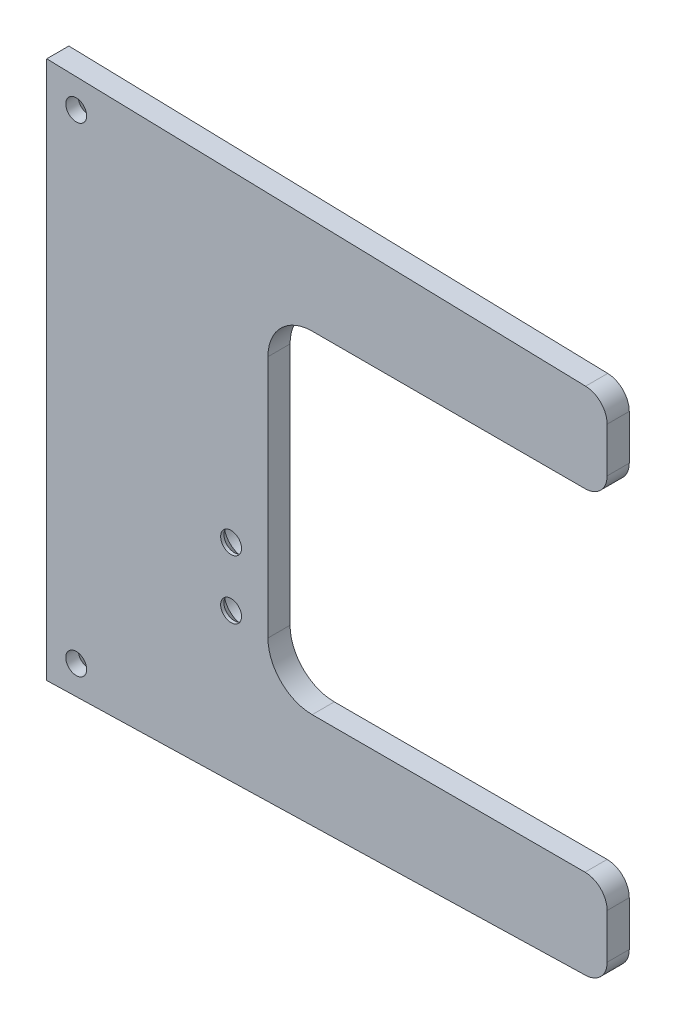
ISO-10303-21;
HEADER;
FILE_DESCRIPTION(('STEP AP214'),'2;1');
FILE_NAME('part.step','',(''),(''),'','','');
FILE_SCHEMA(('AUTOMOTIVE_DESIGN { 1 0 10303 214 1 1 1 1 }'));
ENDSEC;
DATA;
#1=APPLICATION_CONTEXT('core data for automotive mechanical design processes');
#2=APPLICATION_PROTOCOL_DEFINITION('international standard','automotive_design',2000,#1);
#3=PRODUCT_CONTEXT('',#1,'mechanical');
#4=PRODUCT('Part','Part','',(#3));
#5=PRODUCT_RELATED_PRODUCT_CATEGORY('part','',(#4));
#6=PRODUCT_DEFINITION_FORMATION('','',#4);
#7=PRODUCT_DEFINITION_CONTEXT('part definition',#1,'design');
#8=PRODUCT_DEFINITION('design','',#6,#7);
#9=PRODUCT_DEFINITION_SHAPE('','',#8);
#10=(LENGTH_UNIT() NAMED_UNIT(*) SI_UNIT(.MILLI.,.METRE.));
#11=(NAMED_UNIT(*) PLANE_ANGLE_UNIT() SI_UNIT($,.RADIAN.));
#12=(NAMED_UNIT(*) SI_UNIT($,.STERADIAN.) SOLID_ANGLE_UNIT());
#13=UNCERTAINTY_MEASURE_WITH_UNIT(LENGTH_MEASURE(1.E-05),#10,'distance_accuracy_value','');
#14=(GEOMETRIC_REPRESENTATION_CONTEXT(3) GLOBAL_UNCERTAINTY_ASSIGNED_CONTEXT((#13)) GLOBAL_UNIT_ASSIGNED_CONTEXT((#10,
#11,#12)) REPRESENTATION_CONTEXT('',''));
#15=CARTESIAN_POINT('',(0.,0.,0.));
#16=DIRECTION('',(0.,0.,1.));
#17=DIRECTION('',(1.,0.,0.));
#18=AXIS2_PLACEMENT_3D('',#15,#16,#17);
#19=CARTESIAN_POINT('',(-47.625,115.91925,-9.525));
#20=DIRECTION('',(1.,0.,0.));
#21=DIRECTION('',(0.,1.,0.));
#22=AXIS2_PLACEMENT_3D('',#19,#20,#21);
#23=PLANE('',#22);
#24=DIRECTION('',(0.,-1.,0.));
#25=VECTOR('',#24,1.);
#26=CARTESIAN_POINT('',(-47.625,115.91925,0.));
#27=LINE('',#26,#25);
#28=CARTESIAN_POINT('',(-47.625,115.91925,0.));
#29=VERTEX_POINT('',#28);
#30=CARTESIAN_POINT('',(-47.625,-115.91925,0.));
#31=VERTEX_POINT('',#30);
#32=EDGE_CURVE('E176',#29,#31,#27,.T.);
#33=ORIENTED_EDGE('',*,*,#32,.F.);
#34=DIRECTION('',(0.,0.,1.));
#35=VECTOR('',#34,1.);
#36=CARTESIAN_POINT('',(-47.625,115.91925,-9.525));
#37=LINE('',#36,#35);
#38=CARTESIAN_POINT('',(-47.625,115.91925,-9.525));
#39=VERTEX_POINT('',#38);
#40=EDGE_CURVE('E164',#39,#29,#37,.T.);
#41=ORIENTED_EDGE('',*,*,#40,.F.);
#42=DIRECTION('',(0.,-1.,0.));
#43=VECTOR('',#42,1.);
#44=CARTESIAN_POINT('',(-47.625,115.91925,-9.525));
#45=LINE('',#44,#43);
#46=CARTESIAN_POINT('',(-47.625,-115.91925,-9.525));
#47=VERTEX_POINT('',#46);
#48=EDGE_CURVE('E145',#39,#47,#45,.T.);
#49=ORIENTED_EDGE('',*,*,#48,.T.);
#50=DIRECTION('',(0.,0.,1.));
#51=VECTOR('',#50,1.);
#52=CARTESIAN_POINT('',(-47.625,-115.91925,-9.525));
#53=LINE('',#52,#51);
#54=EDGE_CURVE('E156',#47,#31,#53,.T.);
#55=ORIENTED_EDGE('',*,*,#54,.T.);
#56=EDGE_LOOP('',(#33,#41,#49,#55));
#57=FACE_BOUND('',#56,.T.);
#58=ADVANCED_FACE('F39',(#57),#23,.F.);
#59=CARTESIAN_POINT('',(47.625,115.91925,-9.525));
#60=DIRECTION('',(-1.,0.,0.));
#61=DIRECTION('',(0.,-1.,0.));
#62=AXIS2_PLACEMENT_3D('',#59,#60,#61);
#63=PLANE('',#62);
#64=DIRECTION('',(0.,1.,0.));
#65=VECTOR('',#64,1.);
#66=CARTESIAN_POINT('',(47.625,115.91925,-9.525));
#67=LINE('',#66,#65);
#68=CARTESIAN_POINT('',(47.625,-52.4505871253568,-9.525));
#69=VERTEX_POINT('',#68);
#70=CARTESIAN_POINT('',(47.625,52.4505871253569,-9.525));
#71=VERTEX_POINT('',#70);
#72=EDGE_CURVE('E168',#69,#71,#67,.T.);
#73=ORIENTED_EDGE('',*,*,#72,.T.);
#74=DIRECTION('',(0.,0.,-1.));
#75=VECTOR('',#74,1.);
#76=CARTESIAN_POINT('',(47.625,52.4505871253569,-9.525));
#77=LINE('',#76,#75);
#78=CARTESIAN_POINT('',(47.625,52.4505871253569,0.));
#79=VERTEX_POINT('',#78);
#80=EDGE_CURVE('E242',#79,#71,#77,.T.);
#81=ORIENTED_EDGE('',*,*,#80,.F.);
#82=DIRECTION('',(0.,1.,0.));
#83=VECTOR('',#82,1.);
#84=CARTESIAN_POINT('',(47.625,115.91925,0.));
#85=LINE('',#84,#83);
#86=CARTESIAN_POINT('',(47.625,-52.4505871253568,0.));
#87=VERTEX_POINT('',#86);
#88=EDGE_CURVE('E169',#87,#79,#85,.T.);
#89=ORIENTED_EDGE('',*,*,#88,.F.);
#90=DIRECTION('',(0.,0.,-1.));
#91=VECTOR('',#90,1.);
#92=CARTESIAN_POINT('',(47.625,-52.4505871253569,-9.525));
#93=LINE('',#92,#91);
#94=EDGE_CURVE('E246',#69,#87,#93,.F.);
#95=ORIENTED_EDGE('',*,*,#94,.F.);
#96=EDGE_LOOP('',(#73,#81,#89,#95));
#97=FACE_BOUND('',#96,.T.);
#98=ADVANCED_FACE('F363',(#97),#63,.F.);
#99=CARTESIAN_POINT('',(-47.625,-115.91925,-9.525));
#100=DIRECTION('',(0.,0.,-1.));
#101=DIRECTION('',(1.,0.,0.));
#102=AXIS2_PLACEMENT_3D('',#99,#100,#101);
#103=PLANE('',#102);
#104=DIRECTION('',(-0.999657324975558,-0.0261769483078661,0.));
#105=VECTOR('',#104,1.);
#106=CARTESIAN_POINT('',(47.625,-113.425040970536,-9.525));
#107=LINE('',#106,#105);
#108=CARTESIAN_POINT('',(184.399335432632,-109.84347895022,-9.525));
#109=VERTEX_POINT('',#108);
#110=EDGE_CURVE('E139',#109,#47,#107,.T.);
#111=ORIENTED_EDGE('',*,*,#110,.T.);
#112=ORIENTED_EDGE('',*,*,#48,.F.);
#113=DIRECTION('',(0.999657324975557,-0.026176948307866,0.));
#114=VECTOR('',#113,1.);
#115=CARTESIAN_POINT('',(-47.625,115.91925,-9.525));
#116=LINE('',#115,#114);
#117=CARTESIAN_POINT('',(184.399335432632,109.84347895022,-9.525));
#118=VERTEX_POINT('',#117);
#119=EDGE_CURVE('E152',#39,#118,#116,.T.);
#120=ORIENTED_EDGE('',*,*,#119,.T.);
#121=CARTESIAN_POINT('',(184.15,100.321742929828,-9.52500000000001));
#122=DIRECTION('',(0.,0.,1.));
#123=DIRECTION('',(1.,0.,0.));
#124=AXIS2_PLACEMENT_3D('',#121,#122,#123);
#125=CIRCLE('',#124,9.525);
#126=CARTESIAN_POINT('',(193.675,100.321742929828,-9.525));
#127=VERTEX_POINT('',#126);
#128=EDGE_CURVE('E188',#127,#118,#125,.T.);
#129=ORIENTED_EDGE('',*,*,#128,.F.);
#130=DIRECTION('',(0.,1.,0.));
#131=VECTOR('',#130,1.);
#132=CARTESIAN_POINT('',(193.675,109.600587125357,-9.525));
#133=LINE('',#132,#131);
#134=CARTESIAN_POINT('',(193.675,81.0255871253569,-9.525));
#135=VERTEX_POINT('',#134);
#136=EDGE_CURVE('E266',#135,#127,#133,.T.);
#137=ORIENTED_EDGE('',*,*,#136,.F.);
#138=CARTESIAN_POINT('',(184.15,81.0255871253569,-9.52500000000001));
#139=DIRECTION('',(0.,0.,1.));
#140=DIRECTION('',(1.,0.,0.));
#141=AXIS2_PLACEMENT_3D('',#138,#139,#140);
#142=CIRCLE('',#141,9.525);
#143=CARTESIAN_POINT('',(184.15,71.5005871253569,-9.525));
#144=VERTEX_POINT('',#143);
#145=EDGE_CURVE('E192',#144,#135,#142,.T.);
#146=ORIENTED_EDGE('',*,*,#145,.F.);
#147=DIRECTION('',(1.,0.,0.));
#148=VECTOR('',#147,1.);
#149=CARTESIAN_POINT('',(193.675,71.5005871253569,-9.525));
#150=LINE('',#149,#148);
#151=CARTESIAN_POINT('',(66.675,71.5005871253569,-9.525));
#152=VERTEX_POINT('',#151);
#153=EDGE_CURVE('E263',#152,#144,#150,.T.);
#154=ORIENTED_EDGE('',*,*,#153,.F.);
#155=CARTESIAN_POINT('',(66.675,52.4505871253569,-9.525));
#156=DIRECTION('',(0.,0.,1.));
#157=DIRECTION('',(1.,0.,0.));
#158=AXIS2_PLACEMENT_3D('',#155,#156,#157);
#159=CIRCLE('',#158,19.05);
#160=EDGE_CURVE('E48',#71,#152,#159,.F.);
#161=ORIENTED_EDGE('',*,*,#160,.F.);
#162=ORIENTED_EDGE('',*,*,#72,.F.);
#163=CARTESIAN_POINT('',(66.675,-52.4505871253569,-9.52500000000001));
#164=DIRECTION('',(0.,0.,1.));
#165=DIRECTION('',(1.,0.,0.));
#166=AXIS2_PLACEMENT_3D('',#163,#164,#165);
#167=CIRCLE('',#166,19.05);
#168=CARTESIAN_POINT('',(66.675,-71.5005871253569,-9.525));
#169=VERTEX_POINT('',#168);
#170=EDGE_CURVE('E252',#169,#69,#167,.F.);
#171=ORIENTED_EDGE('',*,*,#170,.F.);
#172=DIRECTION('',(-1.,0.,0.));
#173=VECTOR('',#172,1.);
#174=CARTESIAN_POINT('',(47.625,-71.5005871253569,-9.525));
#175=LINE('',#174,#173);
#176=CARTESIAN_POINT('',(184.15,-71.5005871253569,-9.525));
#177=VERTEX_POINT('',#176);
#178=EDGE_CURVE('E403',#177,#169,#175,.T.);
#179=ORIENTED_EDGE('',*,*,#178,.F.);
#180=CARTESIAN_POINT('',(184.15,-81.0255871253569,-9.52500000000001));
#181=DIRECTION('',(0.,0.,1.));
#182=DIRECTION('',(1.,0.,0.));
#183=AXIS2_PLACEMENT_3D('',#180,#181,#182);
#184=CIRCLE('',#183,9.525);
#185=CARTESIAN_POINT('',(193.675,-81.0255871253569,-9.525));
#186=VERTEX_POINT('',#185);
#187=EDGE_CURVE('E196',#186,#177,#184,.T.);
#188=ORIENTED_EDGE('',*,*,#187,.F.);
#189=DIRECTION('',(0.,1.,0.));
#190=VECTOR('',#189,1.);
#191=CARTESIAN_POINT('',(193.675,-71.5005871253569,-9.525));
#192=LINE('',#191,#190);
#193=CARTESIAN_POINT('',(193.675,-100.321742929828,-9.525));
#194=VERTEX_POINT('',#193);
#195=EDGE_CURVE('E407',#194,#186,#192,.T.);
#196=ORIENTED_EDGE('',*,*,#195,.F.);
#197=CARTESIAN_POINT('',(184.15,-100.321742929828,-9.525));
#198=DIRECTION('',(0.,0.,1.));
#199=DIRECTION('',(1.,0.,0.));
#200=AXIS2_PLACEMENT_3D('',#197,#198,#199);
#201=CIRCLE('',#200,9.525);
#202=EDGE_CURVE('E149',#109,#194,#201,.T.);
#203=ORIENTED_EDGE('',*,*,#202,.F.);
#204=EDGE_LOOP('',(#111,#112,#120,#129,#137,#146,#154,#161,#162,#171,#179,#188,#196,#203));
#205=FACE_BOUND('',#204,.T.);
#206=CARTESIAN_POINT('',(-34.925,103.21925,-9.525));
#207=DIRECTION('',(0.,0.,1.));
#208=DIRECTION('',(1.,0.,0.));
#209=AXIS2_PLACEMENT_3D('',#206,#207,#208);
#210=CIRCLE('',#209,8.65);
#211=CARTESIAN_POINT('',(-26.275,103.21925,-9.525));
#212=VERTEX_POINT('',#211);
#213=EDGE_CURVE('E290',#212,#212,#210,.T.);
#214=ORIENTED_EDGE('',*,*,#213,.T.);
#215=EDGE_LOOP('',(#214));
#216=FACE_BOUND('',#215,.T.);
#217=CARTESIAN_POINT('',(-34.925,-103.21925,-9.525));
#218=DIRECTION('',(0.,0.,1.));
#219=DIRECTION('',(1.,0.,0.));
#220=AXIS2_PLACEMENT_3D('',#217,#218,#219);
#221=CIRCLE('',#220,8.65);
#222=CARTESIAN_POINT('',(-26.275,-103.21925,-9.525));
#223=VERTEX_POINT('',#222);
#224=EDGE_CURVE('E302',#223,#223,#221,.T.);
#225=ORIENTED_EDGE('',*,*,#224,.T.);
#226=EDGE_LOOP('',(#225));
#227=FACE_BOUND('',#226,.T.);
#228=CARTESIAN_POINT('',(31.75,-50.15865,-9.525));
#229=DIRECTION('',(0.,0.,1.));
#230=DIRECTION('',(1.,0.,0.));
#231=AXIS2_PLACEMENT_3D('',#228,#229,#230);
#232=CIRCLE('',#231,8.65);
#233=CARTESIAN_POINT('',(40.4,-50.15865,-9.525));
#234=VERTEX_POINT('',#233);
#235=EDGE_CURVE('E326',#234,#234,#232,.T.);
#236=ORIENTED_EDGE('',*,*,#235,.T.);
#237=EDGE_LOOP('',(#236));
#238=FACE_BOUND('',#237,.T.);
#239=CARTESIAN_POINT('',(31.75,-24.75865,-9.525));
#240=DIRECTION('',(0.,0.,1.));
#241=DIRECTION('',(1.,0.,0.));
#242=AXIS2_PLACEMENT_3D('',#239,#240,#241);
#243=CIRCLE('',#242,8.65);
#244=CARTESIAN_POINT('',(40.4,-24.75865,-9.525));
#245=VERTEX_POINT('',#244);
#246=EDGE_CURVE('E179',#245,#245,#243,.T.);
#247=ORIENTED_EDGE('',*,*,#246,.T.);
#248=EDGE_LOOP('',(#247));
#249=FACE_BOUND('',#248,.T.);
#250=ADVANCED_FACE('F141',(#205,#216,#227,#238,#249),#103,.T.);
#251=CARTESIAN_POINT('',(-47.625,-115.91925,0.));
#252=DIRECTION('',(0.,0.,-1.));
#253=DIRECTION('',(1.,0.,0.));
#254=AXIS2_PLACEMENT_3D('',#251,#252,#253);
#255=PLANE('',#254);
#256=CARTESIAN_POINT('',(-34.925,103.21925,0.));
#257=DIRECTION('',(0.,0.,1.));
#258=DIRECTION('',(1.,0.,0.));
#259=AXIS2_PLACEMENT_3D('',#256,#257,#258);
#260=CIRCLE('',#259,4.49999999999999);
#261=CARTESIAN_POINT('',(-30.425,103.21925,0.));
#262=VERTEX_POINT('',#261);
#263=EDGE_CURVE('E298',#262,#262,#260,.T.);
#264=ORIENTED_EDGE('',*,*,#263,.F.);
#265=EDGE_LOOP('',(#264));
#266=FACE_BOUND('',#265,.T.);
#267=CARTESIAN_POINT('',(-34.925,-103.21925,0.));
#268=DIRECTION('',(0.,0.,1.));
#269=DIRECTION('',(1.,0.,0.));
#270=AXIS2_PLACEMENT_3D('',#267,#268,#269);
#271=CIRCLE('',#270,4.49999999999999);
#272=CARTESIAN_POINT('',(-30.425,-103.21925,0.));
#273=VERTEX_POINT('',#272);
#274=EDGE_CURVE('E310',#273,#273,#271,.T.);
#275=ORIENTED_EDGE('',*,*,#274,.F.);
#276=EDGE_LOOP('',(#275));
#277=FACE_BOUND('',#276,.T.);
#278=CARTESIAN_POINT('',(31.75,-50.15865,0.));
#279=DIRECTION('',(0.,0.,1.));
#280=DIRECTION('',(1.,0.,0.));
#281=AXIS2_PLACEMENT_3D('',#278,#279,#280);
#282=CIRCLE('',#281,4.5);
#283=CARTESIAN_POINT('',(36.25,-50.15865,0.));
#284=VERTEX_POINT('',#283);
#285=EDGE_CURVE('E314',#284,#284,#282,.T.);
#286=ORIENTED_EDGE('',*,*,#285,.F.);
#287=EDGE_LOOP('',(#286));
#288=FACE_BOUND('',#287,.T.);
#289=CARTESIAN_POINT('',(31.75,-24.75865,0.));
#290=DIRECTION('',(0.,0.,1.));
#291=DIRECTION('',(1.,0.,0.));
#292=AXIS2_PLACEMENT_3D('',#289,#290,#291);
#293=CIRCLE('',#292,4.5);
#294=CARTESIAN_POINT('',(36.25,-24.75865,0.));
#295=VERTEX_POINT('',#294);
#296=EDGE_CURVE('E330',#295,#295,#293,.T.);
#297=ORIENTED_EDGE('',*,*,#296,.F.);
#298=EDGE_LOOP('',(#297));
#299=FACE_BOUND('',#298,.T.);
#300=DIRECTION('',(0.,-1.,0.));
#301=VECTOR('',#300,1.);
#302=CARTESIAN_POINT('',(193.675,-71.5005871253569,0.));
#303=LINE('',#302,#301);
#304=CARTESIAN_POINT('',(193.675,-81.0255871253569,0.));
#305=VERTEX_POINT('',#304);
#306=CARTESIAN_POINT('',(193.675,-100.321742929828,0.));
#307=VERTEX_POINT('',#306);
#308=EDGE_CURVE('E275',#305,#307,#303,.T.);
#309=ORIENTED_EDGE('',*,*,#308,.F.);
#310=CARTESIAN_POINT('',(184.15,-81.0255871253569,0.));
#311=DIRECTION('',(0.,0.,1.));
#312=DIRECTION('',(1.,0.,0.));
#313=AXIS2_PLACEMENT_3D('',#310,#311,#312);
#314=CIRCLE('',#313,9.525);
#315=CARTESIAN_POINT('',(184.15,-71.5005871253569,0.));
#316=VERTEX_POINT('',#315);
#317=EDGE_CURVE('E216',#316,#305,#314,.F.);
#318=ORIENTED_EDGE('',*,*,#317,.F.);
#319=DIRECTION('',(1.,0.,0.));
#320=VECTOR('',#319,1.);
#321=CARTESIAN_POINT('',(47.625,-71.5005871253569,0.));
#322=LINE('',#321,#320);
#323=CARTESIAN_POINT('',(66.675,-71.5005871253569,0.));
#324=VERTEX_POINT('',#323);
#325=EDGE_CURVE('E267',#324,#316,#322,.T.);
#326=ORIENTED_EDGE('',*,*,#325,.F.);
#327=CARTESIAN_POINT('',(66.675,-52.4505871253569,0.));
#328=DIRECTION('',(0.,0.,1.));
#329=DIRECTION('',(1.,0.,0.));
#330=AXIS2_PLACEMENT_3D('',#327,#328,#329);
#331=CIRCLE('',#330,19.05);
#332=EDGE_CURVE('E255',#87,#324,#331,.T.);
#333=ORIENTED_EDGE('',*,*,#332,.F.);
#334=ORIENTED_EDGE('',*,*,#88,.T.);
#335=CARTESIAN_POINT('',(66.675,52.4505871253569,0.));
#336=DIRECTION('',(0.,0.,1.));
#337=DIRECTION('',(1.,0.,0.));
#338=AXIS2_PLACEMENT_3D('',#335,#336,#337);
#339=CIRCLE('',#338,19.05);
#340=CARTESIAN_POINT('',(66.675,71.5005871253569,0.));
#341=VERTEX_POINT('',#340);
#342=EDGE_CURVE('E11',#341,#79,#339,.T.);
#343=ORIENTED_EDGE('',*,*,#342,.F.);
#344=DIRECTION('',(-1.,0.,0.));
#345=VECTOR('',#344,1.);
#346=CARTESIAN_POINT('',(193.675,71.5005871253569,0.));
#347=LINE('',#346,#345);
#348=CARTESIAN_POINT('',(184.15,71.5005871253569,0.));
#349=VERTEX_POINT('',#348);
#350=EDGE_CURVE('E280',#349,#341,#347,.T.);
#351=ORIENTED_EDGE('',*,*,#350,.F.);
#352=CARTESIAN_POINT('',(184.15,81.0255871253569,0.));
#353=DIRECTION('',(0.,0.,1.));
#354=DIRECTION('',(1.,0.,0.));
#355=AXIS2_PLACEMENT_3D('',#352,#353,#354);
#356=CIRCLE('',#355,9.525);
#357=CARTESIAN_POINT('',(193.675,81.0255871253569,0.));
#358=VERTEX_POINT('',#357);
#359=EDGE_CURVE('E212',#358,#349,#356,.F.);
#360=ORIENTED_EDGE('',*,*,#359,.F.);
#361=DIRECTION('',(0.,-1.,0.));
#362=VECTOR('',#361,1.);
#363=CARTESIAN_POINT('',(193.675,109.600587125357,0.));
#364=LINE('',#363,#362);
#365=CARTESIAN_POINT('',(193.675,100.321742929828,0.));
#366=VERTEX_POINT('',#365);
#367=EDGE_CURVE('E272',#366,#358,#364,.T.);
#368=ORIENTED_EDGE('',*,*,#367,.F.);
#369=CARTESIAN_POINT('',(184.15,100.321742929828,0.));
#370=DIRECTION('',(0.,0.,1.));
#371=DIRECTION('',(1.,0.,0.));
#372=AXIS2_PLACEMENT_3D('',#369,#370,#371);
#373=CIRCLE('',#372,9.525);
#374=CARTESIAN_POINT('',(184.399335432632,109.84347895022,0.));
#375=VERTEX_POINT('',#374);
#376=EDGE_CURVE('E208',#375,#366,#373,.F.);
#377=ORIENTED_EDGE('',*,*,#376,.F.);
#378=DIRECTION('',(-0.999657324975558,0.026176948307866,0.));
#379=VECTOR('',#378,1.);
#380=CARTESIAN_POINT('',(-47.625,115.91925,0.));
#381=LINE('',#380,#379);
#382=EDGE_CURVE('E287',#375,#29,#381,.T.);
#383=ORIENTED_EDGE('',*,*,#382,.T.);
#384=ORIENTED_EDGE('',*,*,#32,.T.);
#385=DIRECTION('',(0.999657324975558,0.0261769483078661,0.));
#386=VECTOR('',#385,1.);
#387=CARTESIAN_POINT('',(47.625,-113.425040970536,0.));
#388=LINE('',#387,#386);
#389=CARTESIAN_POINT('',(184.399335432632,-109.84347895022,0.));
#390=VERTEX_POINT('',#389);
#391=EDGE_CURVE('E153',#31,#390,#388,.T.);
#392=ORIENTED_EDGE('',*,*,#391,.T.);
#393=CARTESIAN_POINT('',(184.15,-100.321742929828,0.));
#394=DIRECTION('',(0.,0.,1.));
#395=DIRECTION('',(1.,0.,0.));
#396=AXIS2_PLACEMENT_3D('',#393,#394,#395);
#397=CIRCLE('',#396,9.525);
#398=EDGE_CURVE('E220',#307,#390,#397,.F.);
#399=ORIENTED_EDGE('',*,*,#398,.F.);
#400=EDGE_LOOP('',(#309,#318,#326,#333,#334,#343,#351,#360,#368,#377,#383,#384,#392,#399));
#401=FACE_BOUND('',#400,.T.);
#402=ADVANCED_FACE('F350',(#266,#277,#288,#299,#401),#255,.F.);
#403=CARTESIAN_POINT('',(31.75,-24.75865,-9.525));
#404=DIRECTION('',(0.,0.,-1.));
#405=DIRECTION('',(1.,0.,0.));
#406=AXIS2_PLACEMENT_3D('',#403,#404,#405);
#407=CYLINDRICAL_SURFACE('',#406,8.65);
#408=CARTESIAN_POINT('',(31.75,-24.75865,-5.5626));
#409=DIRECTION('',(0.,0.,1.));
#410=DIRECTION('',(1.,0.,0.));
#411=AXIS2_PLACEMENT_3D('',#408,#409,#410);
#412=CIRCLE('',#411,8.65);
#413=CARTESIAN_POINT('',(40.4,-24.75865,-5.5626));
#414=VERTEX_POINT('',#413);
#415=EDGE_CURVE('E337',#414,#414,#412,.T.);
#416=ORIENTED_EDGE('',*,*,#415,.T.);
#417=EDGE_LOOP('',(#416));
#418=FACE_BOUND('',#417,.T.);
#419=ORIENTED_EDGE('',*,*,#246,.F.);
#420=EDGE_LOOP('',(#419));
#421=FACE_BOUND('',#420,.T.);
#422=ADVANCED_FACE('F347',(#418,#421),#407,.F.);
#423=CARTESIAN_POINT('',(31.75,-24.75865,-5.5626));
#424=DIRECTION('',(0.,0.,-1.));
#425=DIRECTION('',(1.,0.,0.));
#426=AXIS2_PLACEMENT_3D('',#423,#424,#425);
#427=CONICAL_SURFACE('',#426,8.65,0.785398163397449);
#428=CARTESIAN_POINT('',(31.75,-24.75865,-1.41260000000001));
#429=DIRECTION('',(0.,0.,1.));
#430=DIRECTION('',(1.,0.,0.));
#431=AXIS2_PLACEMENT_3D('',#428,#429,#430);
#432=CIRCLE('',#431,4.5);
#433=CARTESIAN_POINT('',(36.25,-24.75865,-1.41260000000001));
#434=VERTEX_POINT('',#433);
#435=EDGE_CURVE('E334',#434,#434,#432,.T.);
#436=ORIENTED_EDGE('',*,*,#435,.T.);
#437=EDGE_LOOP('',(#436));
#438=FACE_BOUND('',#437,.T.);
#439=ORIENTED_EDGE('',*,*,#415,.F.);
#440=EDGE_LOOP('',(#439));
#441=FACE_BOUND('',#440,.T.);
#442=ADVANCED_FACE('F349',(#438,#441),#427,.F.);
#443=CARTESIAN_POINT('',(31.75,-24.75865,-9.525));
#444=DIRECTION('',(0.,0.,-1.));
#445=DIRECTION('',(1.,0.,0.));
#446=AXIS2_PLACEMENT_3D('',#443,#444,#445);
#447=CYLINDRICAL_SURFACE('',#446,4.5);
#448=ORIENTED_EDGE('',*,*,#296,.T.);
#449=EDGE_LOOP('',(#448));
#450=FACE_BOUND('',#449,.T.);
#451=ORIENTED_EDGE('',*,*,#435,.F.);
#452=EDGE_LOOP('',(#451));
#453=FACE_BOUND('',#452,.T.);
#454=ADVANCED_FACE('F356',(#450,#453),#447,.F.);
#455=CARTESIAN_POINT('',(31.75,-50.15865,-9.525));
#456=DIRECTION('',(0.,0.,-1.));
#457=DIRECTION('',(1.,0.,0.));
#458=AXIS2_PLACEMENT_3D('',#455,#456,#457);
#459=CYLINDRICAL_SURFACE('',#458,8.65);
#460=CARTESIAN_POINT('',(31.75,-50.15865,-5.5626));
#461=DIRECTION('',(0.,0.,1.));
#462=DIRECTION('',(1.,0.,0.));
#463=AXIS2_PLACEMENT_3D('',#460,#461,#462);
#464=CIRCLE('',#463,8.65);
#465=CARTESIAN_POINT('',(40.4,-50.15865,-5.5626));
#466=VERTEX_POINT('',#465);
#467=EDGE_CURVE('E322',#466,#466,#464,.T.);
#468=ORIENTED_EDGE('',*,*,#467,.T.);
#469=EDGE_LOOP('',(#468));
#470=FACE_BOUND('',#469,.T.);
#471=ORIENTED_EDGE('',*,*,#235,.F.);
#472=EDGE_LOOP('',(#471));
#473=FACE_BOUND('',#472,.T.);
#474=ADVANCED_FACE('F468',(#470,#473),#459,.F.);
#475=CARTESIAN_POINT('',(31.75,-50.15865,-5.5626));
#476=DIRECTION('',(0.,0.,-1.));
#477=DIRECTION('',(1.,0.,0.));
#478=AXIS2_PLACEMENT_3D('',#475,#476,#477);
#479=CONICAL_SURFACE('',#478,8.65,0.785398163397449);
#480=CARTESIAN_POINT('',(31.75,-50.15865,-1.41260000000001));
#481=DIRECTION('',(0.,0.,1.));
#482=DIRECTION('',(1.,0.,0.));
#483=AXIS2_PLACEMENT_3D('',#480,#481,#482);
#484=CIRCLE('',#483,4.5);
#485=CARTESIAN_POINT('',(36.25,-50.15865,-1.41260000000001));
#486=VERTEX_POINT('',#485);
#487=EDGE_CURVE('E318',#486,#486,#484,.T.);
#488=ORIENTED_EDGE('',*,*,#487,.T.);
#489=EDGE_LOOP('',(#488));
#490=FACE_BOUND('',#489,.T.);
#491=ORIENTED_EDGE('',*,*,#467,.F.);
#492=EDGE_LOOP('',(#491));
#493=FACE_BOUND('',#492,.T.);
#494=ADVANCED_FACE('F464',(#490,#493),#479,.F.);
#495=CARTESIAN_POINT('',(31.75,-50.15865,-9.525));
#496=DIRECTION('',(0.,0.,-1.));
#497=DIRECTION('',(1.,0.,0.));
#498=AXIS2_PLACEMENT_3D('',#495,#496,#497);
#499=CYLINDRICAL_SURFACE('',#498,4.5);
#500=ORIENTED_EDGE('',*,*,#285,.T.);
#501=EDGE_LOOP('',(#500));
#502=FACE_BOUND('',#501,.T.);
#503=ORIENTED_EDGE('',*,*,#487,.F.);
#504=EDGE_LOOP('',(#503));
#505=FACE_BOUND('',#504,.T.);
#506=ADVANCED_FACE('F460',(#502,#505),#499,.F.);
#507=CARTESIAN_POINT('',(-34.925,-103.21925,-9.525));
#508=DIRECTION('',(0.,0.,-1.));
#509=DIRECTION('',(1.,0.,0.));
#510=AXIS2_PLACEMENT_3D('',#507,#508,#509);
#511=CYLINDRICAL_SURFACE('',#510,4.49999999999999);
#512=ORIENTED_EDGE('',*,*,#274,.T.);
#513=EDGE_LOOP('',(#512));
#514=FACE_BOUND('',#513,.T.);
#515=CARTESIAN_POINT('',(-34.925,-103.21925,-5.375));
#516=DIRECTION('',(0.,0.,1.));
#517=DIRECTION('',(1.,0.,0.));
#518=AXIS2_PLACEMENT_3D('',#515,#516,#517);
#519=CIRCLE('',#518,4.5);
#520=CARTESIAN_POINT('',(-30.425,-103.21925,-5.375));
#521=VERTEX_POINT('',#520);
#522=EDGE_CURVE('E306',#521,#521,#519,.T.);
#523=ORIENTED_EDGE('',*,*,#522,.F.);
#524=EDGE_LOOP('',(#523));
#525=FACE_BOUND('',#524,.T.);
#526=ADVANCED_FACE('F456',(#514,#525),#511,.F.);
#527=CARTESIAN_POINT('',(-34.925,-103.21925,-9.525));
#528=DIRECTION('',(0.,0.,-1.));
#529=DIRECTION('',(1.,0.,0.));
#530=AXIS2_PLACEMENT_3D('',#527,#528,#529);
#531=CONICAL_SURFACE('',#530,8.65,0.785398163397448);
#532=ORIENTED_EDGE('',*,*,#522,.T.);
#533=EDGE_LOOP('',(#532));
#534=FACE_BOUND('',#533,.T.);
#535=ORIENTED_EDGE('',*,*,#224,.F.);
#536=EDGE_LOOP('',(#535));
#537=FACE_BOUND('',#536,.T.);
#538=ADVANCED_FACE('F452',(#534,#537),#531,.F.);
#539=CARTESIAN_POINT('',(-34.925,103.21925,-9.525));
#540=DIRECTION('',(0.,0.,-1.));
#541=DIRECTION('',(1.,0.,0.));
#542=AXIS2_PLACEMENT_3D('',#539,#540,#541);
#543=CYLINDRICAL_SURFACE('',#542,4.49999999999999);
#544=ORIENTED_EDGE('',*,*,#263,.T.);
#545=EDGE_LOOP('',(#544));
#546=FACE_BOUND('',#545,.T.);
#547=CARTESIAN_POINT('',(-34.925,103.21925,-5.375));
#548=DIRECTION('',(0.,0.,1.));
#549=DIRECTION('',(1.,0.,0.));
#550=AXIS2_PLACEMENT_3D('',#547,#548,#549);
#551=CIRCLE('',#550,4.5);
#552=CARTESIAN_POINT('',(-30.425,103.21925,-5.375));
#553=VERTEX_POINT('',#552);
#554=EDGE_CURVE('E294',#553,#553,#551,.T.);
#555=ORIENTED_EDGE('',*,*,#554,.F.);
#556=EDGE_LOOP('',(#555));
#557=FACE_BOUND('',#556,.T.);
#558=ADVANCED_FACE('F448',(#546,#557),#543,.F.);
#559=CARTESIAN_POINT('',(-34.925,103.21925,-9.525));
#560=DIRECTION('',(0.,0.,-1.));
#561=DIRECTION('',(1.,0.,0.));
#562=AXIS2_PLACEMENT_3D('',#559,#560,#561);
#563=CONICAL_SURFACE('',#562,8.65,0.785398163397448);
#564=ORIENTED_EDGE('',*,*,#554,.T.);
#565=EDGE_LOOP('',(#564));
#566=FACE_BOUND('',#565,.T.);
#567=ORIENTED_EDGE('',*,*,#213,.F.);
#568=EDGE_LOOP('',(#567));
#569=FACE_BOUND('',#568,.T.);
#570=ADVANCED_FACE('F445',(#566,#569),#563,.F.);
#571=CARTESIAN_POINT('',(-47.625,115.91925,0.00100000000000447));
#572=DIRECTION('',(-0.026176948307866,-0.999657324975557,0.));
#573=DIRECTION('',(0.999657324975558,-0.026176948307866,0.));
#574=AXIS2_PLACEMENT_3D('',#571,#572,#573);
#575=PLANE('',#574);
#576=ORIENTED_EDGE('',*,*,#119,.F.);
#577=ORIENTED_EDGE('',*,*,#40,.T.);
#578=ORIENTED_EDGE('',*,*,#382,.F.);
#579=DIRECTION('',(0.,0.,-1.));
#580=VECTOR('',#579,1.);
#581=CARTESIAN_POINT('',(184.399335432632,109.84347895022,0.));
#582=LINE('',#581,#580);
#583=EDGE_CURVE('E236',#118,#375,#582,.F.);
#584=ORIENTED_EDGE('',*,*,#583,.F.);
#585=EDGE_LOOP('',(#576,#577,#578,#584));
#586=FACE_BOUND('',#585,.T.);
#587=ADVANCED_FACE('F421',(#586),#575,.F.);
#588=CARTESIAN_POINT('',(47.625,-113.425040970536,0.00100000000000447));
#589=DIRECTION('',(-0.0261769483078661,0.999657324975557,0.));
#590=DIRECTION('',(-0.999657324975558,-0.0261769483078661,0.));
#591=AXIS2_PLACEMENT_3D('',#588,#589,#590);
#592=PLANE('',#591);
#593=ORIENTED_EDGE('',*,*,#391,.F.);
#594=ORIENTED_EDGE('',*,*,#54,.F.);
#595=ORIENTED_EDGE('',*,*,#110,.F.);
#596=DIRECTION('',(0.,0.,-1.));
#597=VECTOR('',#596,1.);
#598=CARTESIAN_POINT('',(184.399335432632,-109.84347895022,-9.525));
#599=LINE('',#598,#597);
#600=EDGE_CURVE('E163',#390,#109,#599,.T.);
#601=ORIENTED_EDGE('',*,*,#600,.F.);
#602=EDGE_LOOP('',(#593,#594,#595,#601));
#603=FACE_BOUND('',#602,.T.);
#604=ADVANCED_FACE('F157',(#603),#592,.F.);
#605=CARTESIAN_POINT('',(193.675,109.600587125357,151.948222530626));
#606=DIRECTION('',(1.,0.,0.));
#607=DIRECTION('',(0.,0.,1.));
#608=AXIS2_PLACEMENT_3D('',#605,#606,#607);
#609=PLANE('',#608);
#610=ORIENTED_EDGE('',*,*,#136,.T.);
#611=DIRECTION('',(0.,0.,-1.));
#612=VECTOR('',#611,1.);
#613=CARTESIAN_POINT('',(193.675,100.321742929828,-9.52500000000001));
#614=LINE('',#613,#612);
#615=EDGE_CURVE('E230',#366,#127,#614,.T.);
#616=ORIENTED_EDGE('',*,*,#615,.F.);
#617=ORIENTED_EDGE('',*,*,#367,.T.);
#618=DIRECTION('',(0.,0.,-1.));
#619=VECTOR('',#618,1.);
#620=CARTESIAN_POINT('',(193.675,81.0255871253569,151.948222530626));
#621=LINE('',#620,#619);
#622=EDGE_CURVE('E233',#135,#358,#621,.F.);
#623=ORIENTED_EDGE('',*,*,#622,.F.);
#624=EDGE_LOOP('',(#610,#616,#617,#623));
#625=FACE_BOUND('',#624,.T.);
#626=ADVANCED_FACE('F415',(#625),#609,.T.);
#627=CARTESIAN_POINT('',(193.675,71.5005871253569,151.948222530626));
#628=DIRECTION('',(0.,-1.,0.));
#629=DIRECTION('',(1.,0.,0.));
#630=AXIS2_PLACEMENT_3D('',#627,#628,#629);
#631=PLANE('',#630);
#632=ORIENTED_EDGE('',*,*,#153,.T.);
#633=DIRECTION('',(0.,0.,-1.));
#634=VECTOR('',#633,1.);
#635=CARTESIAN_POINT('',(184.15,71.5005871253569,151.948222530626));
#636=LINE('',#635,#634);
#637=EDGE_CURVE('E227',#349,#144,#636,.T.);
#638=ORIENTED_EDGE('',*,*,#637,.F.);
#639=ORIENTED_EDGE('',*,*,#350,.T.);
#640=DIRECTION('',(0.,0.,-1.));
#641=VECTOR('',#640,1.);
#642=CARTESIAN_POINT('',(66.675,71.5005871253569,151.948222530626));
#643=LINE('',#642,#641);
#644=EDGE_CURVE('E55',#152,#341,#643,.F.);
#645=ORIENTED_EDGE('',*,*,#644,.F.);
#646=EDGE_LOOP('',(#632,#638,#639,#645));
#647=FACE_BOUND('',#646,.T.);
#648=ADVANCED_FACE('F412',(#647),#631,.T.);
#649=CARTESIAN_POINT('',(47.625,-71.5005871253569,151.948222530626));
#650=DIRECTION('',(0.,1.,0.));
#651=DIRECTION('',(0.,0.,-1.));
#652=AXIS2_PLACEMENT_3D('',#649,#650,#651);
#653=PLANE('',#652);
#654=ORIENTED_EDGE('',*,*,#325,.T.);
#655=DIRECTION('',(0.,0.,-1.));
#656=VECTOR('',#655,1.);
#657=CARTESIAN_POINT('',(184.15,-71.5005871253569,151.948222530626));
#658=LINE('',#657,#656);
#659=EDGE_CURVE('E224',#177,#316,#658,.F.);
#660=ORIENTED_EDGE('',*,*,#659,.F.);
#661=ORIENTED_EDGE('',*,*,#178,.T.);
#662=DIRECTION('',(0.,0.,-1.));
#663=VECTOR('',#662,1.);
#664=CARTESIAN_POINT('',(66.675,-71.5005871253569,151.948222530626));
#665=LINE('',#664,#663);
#666=EDGE_CURVE('E239',#324,#169,#665,.T.);
#667=ORIENTED_EDGE('',*,*,#666,.F.);
#668=EDGE_LOOP('',(#654,#660,#661,#667));
#669=FACE_BOUND('',#668,.T.);
#670=ADVANCED_FACE('F401',(#669),#653,.T.);
#671=CARTESIAN_POINT('',(193.675,-71.5005871253569,151.948222530626));
#672=DIRECTION('',(1.,0.,0.));
#673=DIRECTION('',(0.,1.,0.));
#674=AXIS2_PLACEMENT_3D('',#671,#672,#673);
#675=PLANE('',#674);
#676=ORIENTED_EDGE('',*,*,#195,.T.);
#677=DIRECTION('',(0.,0.,-1.));
#678=VECTOR('',#677,1.);
#679=CARTESIAN_POINT('',(193.675,-81.0255871253569,151.948222530626));
#680=LINE('',#679,#678);
#681=EDGE_CURVE('E202',#305,#186,#680,.T.);
#682=ORIENTED_EDGE('',*,*,#681,.F.);
#683=ORIENTED_EDGE('',*,*,#308,.T.);
#684=DIRECTION('',(0.,0.,-1.));
#685=VECTOR('',#684,1.);
#686=CARTESIAN_POINT('',(193.675,-100.321742929828,0.));
#687=LINE('',#686,#685);
#688=EDGE_CURVE('E205',#194,#307,#687,.F.);
#689=ORIENTED_EDGE('',*,*,#688,.F.);
#690=EDGE_LOOP('',(#676,#682,#683,#689));
#691=FACE_BOUND('',#690,.T.);
#692=ADVANCED_FACE('F375',(#691),#675,.T.);
#693=CARTESIAN_POINT('',(184.15,-100.321742929828,0.00100000000000447));
#694=DIRECTION('',(0.,0.,1.));
#695=DIRECTION('',(-1.,0.,0.));
#696=AXIS2_PLACEMENT_3D('',#693,#694,#695);
#697=CYLINDRICAL_SURFACE('',#696,9.525);
#698=ORIENTED_EDGE('',*,*,#398,.T.);
#699=ORIENTED_EDGE('',*,*,#600,.T.);
#700=ORIENTED_EDGE('',*,*,#202,.T.);
#701=ORIENTED_EDGE('',*,*,#688,.T.);
#702=EDGE_LOOP('',(#698,#699,#700,#701));
#703=FACE_BOUND('',#702,.T.);
#704=ADVANCED_FACE('F371',(#703),#697,.T.);
#705=CARTESIAN_POINT('',(184.15,-81.0255871253569,151.948222530626));
#706=DIRECTION('',(0.,0.,-1.));
#707=DIRECTION('',(1.,0.,0.));
#708=AXIS2_PLACEMENT_3D('',#705,#706,#707);
#709=CYLINDRICAL_SURFACE('',#708,9.525);
#710=ORIENTED_EDGE('',*,*,#317,.T.);
#711=ORIENTED_EDGE('',*,*,#681,.T.);
#712=ORIENTED_EDGE('',*,*,#187,.T.);
#713=ORIENTED_EDGE('',*,*,#659,.T.);
#714=EDGE_LOOP('',(#710,#711,#712,#713));
#715=FACE_BOUND('',#714,.T.);
#716=ADVANCED_FACE('F374',(#715),#709,.T.);
#717=CARTESIAN_POINT('',(184.15,81.0255871253569,151.948222530626));
#718=DIRECTION('',(0.,0.,-1.));
#719=DIRECTION('',(1.,0.,0.));
#720=AXIS2_PLACEMENT_3D('',#717,#718,#719);
#721=CYLINDRICAL_SURFACE('',#720,9.525);
#722=ORIENTED_EDGE('',*,*,#359,.T.);
#723=ORIENTED_EDGE('',*,*,#637,.T.);
#724=ORIENTED_EDGE('',*,*,#145,.T.);
#725=ORIENTED_EDGE('',*,*,#622,.T.);
#726=EDGE_LOOP('',(#722,#723,#724,#725));
#727=FACE_BOUND('',#726,.T.);
#728=ADVANCED_FACE('F379',(#727),#721,.T.);
#729=CARTESIAN_POINT('',(184.15,100.321742929828,151.948222530626));
#730=DIRECTION('',(0.,0.,1.));
#731=DIRECTION('',(-1.,0.,0.));
#732=AXIS2_PLACEMENT_3D('',#729,#730,#731);
#733=CYLINDRICAL_SURFACE('',#732,9.525);
#734=ORIENTED_EDGE('',*,*,#376,.T.);
#735=ORIENTED_EDGE('',*,*,#615,.T.);
#736=ORIENTED_EDGE('',*,*,#128,.T.);
#737=ORIENTED_EDGE('',*,*,#583,.T.);
#738=EDGE_LOOP('',(#734,#735,#736,#737));
#739=FACE_BOUND('',#738,.T.);
#740=ADVANCED_FACE('F383',(#739),#733,.T.);
#741=CARTESIAN_POINT('',(66.675,-52.4505871253569,151.948222530626));
#742=DIRECTION('',(0.,0.,-1.));
#743=DIRECTION('',(1.,0.,0.));
#744=AXIS2_PLACEMENT_3D('',#741,#742,#743);
#745=CYLINDRICAL_SURFACE('',#744,19.05);
#746=ORIENTED_EDGE('',*,*,#332,.T.);
#747=ORIENTED_EDGE('',*,*,#666,.T.);
#748=ORIENTED_EDGE('',*,*,#170,.T.);
#749=ORIENTED_EDGE('',*,*,#94,.T.);
#750=EDGE_LOOP('',(#746,#747,#748,#749));
#751=FACE_BOUND('',#750,.T.);
#752=ADVANCED_FACE('F386',(#751),#745,.F.);
#753=CARTESIAN_POINT('',(66.675,52.4505871253569,-9.525));
#754=DIRECTION('',(0.,0.,-1.));
#755=DIRECTION('',(1.,0.,0.));
#756=AXIS2_PLACEMENT_3D('',#753,#754,#755);
#757=CYLINDRICAL_SURFACE('',#756,19.05);
#758=ORIENTED_EDGE('',*,*,#342,.T.);
#759=ORIENTED_EDGE('',*,*,#80,.T.);
#760=ORIENTED_EDGE('',*,*,#160,.T.);
#761=ORIENTED_EDGE('',*,*,#644,.T.);
#762=EDGE_LOOP('',(#758,#759,#760,#761));
#763=FACE_BOUND('',#762,.T.);
#764=ADVANCED_FACE('F41',(#763),#757,.F.);
#765=CLOSED_SHELL('',(#58,#98,#250,#402,#422,#442,#454,#474,#494,#506,#526,#538,#558,#570,#587,
#604,#626,#648,#670,#692,#704,#716,#728,#740,#752,#764));
#766=MANIFOLD_SOLID_BREP('B2',#765);
#767=ADVANCED_BREP_SHAPE_REPRESENTATION('',(#18,#766),#14);
#768=SHAPE_DEFINITION_REPRESENTATION(#9,#767);
ENDSEC;
END-ISO-10303-21;
